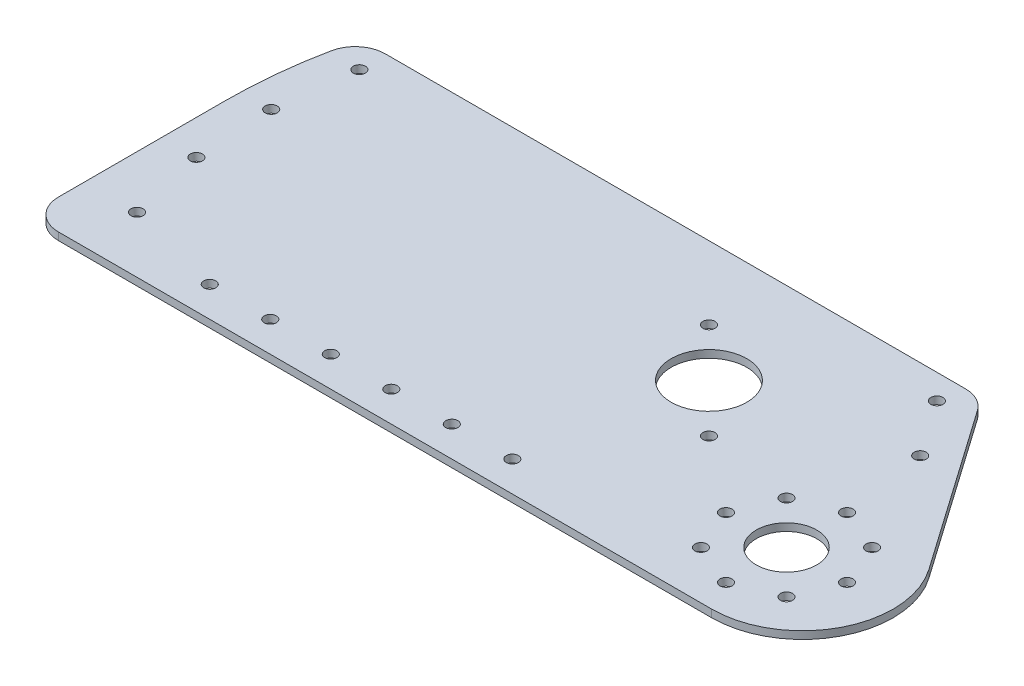
ISO-10303-21;
HEADER;
FILE_DESCRIPTION(('STEP AP214'),'2;1');
FILE_NAME('part.step','',(''),(''),'','','');
FILE_SCHEMA(('AUTOMOTIVE_DESIGN { 1 0 10303 214 1 1 1 1 }'));
ENDSEC;
DATA;
#1=APPLICATION_CONTEXT('core data for automotive mechanical design processes');
#2=APPLICATION_PROTOCOL_DEFINITION('international standard','automotive_design',2000,#1);
#3=PRODUCT_CONTEXT('',#1,'mechanical');
#4=PRODUCT('Part','Part','',(#3));
#5=PRODUCT_RELATED_PRODUCT_CATEGORY('part','',(#4));
#6=PRODUCT_DEFINITION_FORMATION('','',#4);
#7=PRODUCT_DEFINITION_CONTEXT('part definition',#1,'design');
#8=PRODUCT_DEFINITION('design','',#6,#7);
#9=PRODUCT_DEFINITION_SHAPE('','',#8);
#10=(LENGTH_UNIT() NAMED_UNIT(*) SI_UNIT(.MILLI.,.METRE.));
#11=(NAMED_UNIT(*) PLANE_ANGLE_UNIT() SI_UNIT($,.RADIAN.));
#12=(NAMED_UNIT(*) SI_UNIT($,.STERADIAN.) SOLID_ANGLE_UNIT());
#13=UNCERTAINTY_MEASURE_WITH_UNIT(LENGTH_MEASURE(1.E-05),#10,'distance_accuracy_value','');
#14=(GEOMETRIC_REPRESENTATION_CONTEXT(3) GLOBAL_UNCERTAINTY_ASSIGNED_CONTEXT((#13)) GLOBAL_UNIT_ASSIGNED_CONTEXT((#10,
#11,#12)) REPRESENTATION_CONTEXT('',''));
#15=CARTESIAN_POINT('',(0.,0.,0.));
#16=DIRECTION('',(0.,0.,1.));
#17=DIRECTION('',(1.,0.,0.));
#18=AXIS2_PLACEMENT_3D('',#15,#16,#17);
#19=CARTESIAN_POINT('',(-12.7,0.,69.8499999999995));
#20=DIRECTION('',(0.,1.,0.));
#21=DIRECTION('',(0.,0.,1.));
#22=AXIS2_PLACEMENT_3D('',#19,#20,#21);
#23=CYLINDRICAL_SURFACE('',#22,2.54000000000001);
#24=CARTESIAN_POINT('',(-12.7,0.,69.8499999999995));
#25=DIRECTION('',(0.,1.,0.));
#26=DIRECTION('',(0.,0.,1.));
#27=AXIS2_PLACEMENT_3D('',#24,#25,#26);
#28=CIRCLE('',#27,2.54000000000001);
#29=CARTESIAN_POINT('',(-12.7,0.,72.3899999999995));
#30=VERTEX_POINT('',#29);
#31=EDGE_CURVE('E51',#30,#30,#28,.T.);
#32=ORIENTED_EDGE('',*,*,#31,.F.);
#33=EDGE_LOOP('',(#32));
#34=FACE_BOUND('',#33,.T.);
#35=CARTESIAN_POINT('',(-12.7,3.175,69.8499999999995));
#36=DIRECTION('',(0.,1.,0.));
#37=DIRECTION('',(0.,0.,1.));
#38=AXIS2_PLACEMENT_3D('',#35,#36,#37);
#39=CIRCLE('',#38,2.54000000000001);
#40=CARTESIAN_POINT('',(-12.7,3.175,72.3899999999995));
#41=VERTEX_POINT('',#40);
#42=EDGE_CURVE('E11',#41,#41,#39,.T.);
#43=ORIENTED_EDGE('',*,*,#42,.T.);
#44=EDGE_LOOP('',(#43));
#45=FACE_BOUND('',#44,.T.);
#46=ADVANCED_FACE('F43',(#34,#45),#23,.F.);
#47=CARTESIAN_POINT('',(-38.1,0.,69.8499999999995));
#48=DIRECTION('',(0.,1.,0.));
#49=DIRECTION('',(0.,0.,1.));
#50=AXIS2_PLACEMENT_3D('',#47,#48,#49);
#51=CYLINDRICAL_SURFACE('',#50,2.54000000000001);
#52=CARTESIAN_POINT('',(-38.1,0.,69.8499999999995));
#53=DIRECTION('',(0.,1.,0.));
#54=DIRECTION('',(0.,0.,1.));
#55=AXIS2_PLACEMENT_3D('',#52,#53,#54);
#56=CIRCLE('',#55,2.54000000000001);
#57=CARTESIAN_POINT('',(-38.1,0.,72.3899999999995));
#58=VERTEX_POINT('',#57);
#59=EDGE_CURVE('E194',#58,#58,#56,.T.);
#60=ORIENTED_EDGE('',*,*,#59,.F.);
#61=EDGE_LOOP('',(#60));
#62=FACE_BOUND('',#61,.T.);
#63=CARTESIAN_POINT('',(-38.1,3.175,69.8499999999995));
#64=DIRECTION('',(0.,1.,0.));
#65=DIRECTION('',(0.,0.,1.));
#66=AXIS2_PLACEMENT_3D('',#63,#64,#65);
#67=CIRCLE('',#66,2.54000000000001);
#68=CARTESIAN_POINT('',(-38.1,3.175,72.3899999999995));
#69=VERTEX_POINT('',#68);
#70=EDGE_CURVE('E197',#69,#69,#67,.T.);
#71=ORIENTED_EDGE('',*,*,#70,.T.);
#72=EDGE_LOOP('',(#71));
#73=FACE_BOUND('',#72,.T.);
#74=ADVANCED_FACE('F206',(#62,#73),#51,.F.);
#75=CARTESIAN_POINT('',(-63.5,0.,69.8499999999995));
#76=DIRECTION('',(0.,1.,0.));
#77=DIRECTION('',(0.,0.,1.));
#78=AXIS2_PLACEMENT_3D('',#75,#76,#77);
#79=CYLINDRICAL_SURFACE('',#78,2.54000000000001);
#80=CARTESIAN_POINT('',(-63.5,0.,69.8499999999995));
#81=DIRECTION('',(0.,1.,0.));
#82=DIRECTION('',(0.,0.,1.));
#83=AXIS2_PLACEMENT_3D('',#80,#81,#82);
#84=CIRCLE('',#83,2.54000000000001);
#85=CARTESIAN_POINT('',(-63.5,0.,72.3899999999995));
#86=VERTEX_POINT('',#85);
#87=EDGE_CURVE('E188',#86,#86,#84,.T.);
#88=ORIENTED_EDGE('',*,*,#87,.F.);
#89=EDGE_LOOP('',(#88));
#90=FACE_BOUND('',#89,.T.);
#91=CARTESIAN_POINT('',(-63.5,3.175,69.8499999999995));
#92=DIRECTION('',(0.,1.,0.));
#93=DIRECTION('',(0.,0.,1.));
#94=AXIS2_PLACEMENT_3D('',#91,#92,#93);
#95=CIRCLE('',#94,2.54000000000001);
#96=CARTESIAN_POINT('',(-63.5,3.175,72.3899999999995));
#97=VERTEX_POINT('',#96);
#98=EDGE_CURVE('E191',#97,#97,#95,.T.);
#99=ORIENTED_EDGE('',*,*,#98,.T.);
#100=EDGE_LOOP('',(#99));
#101=FACE_BOUND('',#100,.T.);
#102=ADVANCED_FACE('F221',(#90,#101),#79,.F.);
#103=CARTESIAN_POINT('',(-88.9,0.,69.8499999999995));
#104=DIRECTION('',(0.,1.,0.));
#105=DIRECTION('',(0.,0.,1.));
#106=AXIS2_PLACEMENT_3D('',#103,#104,#105);
#107=CYLINDRICAL_SURFACE('',#106,2.54000000000001);
#108=CARTESIAN_POINT('',(-88.9,0.,69.8499999999995));
#109=DIRECTION('',(0.,1.,0.));
#110=DIRECTION('',(0.,0.,1.));
#111=AXIS2_PLACEMENT_3D('',#108,#109,#110);
#112=CIRCLE('',#111,2.54000000000001);
#113=CARTESIAN_POINT('',(-88.9,0.,72.3899999999995));
#114=VERTEX_POINT('',#113);
#115=EDGE_CURVE('E182',#114,#114,#112,.T.);
#116=ORIENTED_EDGE('',*,*,#115,.F.);
#117=EDGE_LOOP('',(#116));
#118=FACE_BOUND('',#117,.T.);
#119=CARTESIAN_POINT('',(-88.9,3.175,69.8499999999995));
#120=DIRECTION('',(0.,1.,0.));
#121=DIRECTION('',(0.,0.,1.));
#122=AXIS2_PLACEMENT_3D('',#119,#120,#121);
#123=CIRCLE('',#122,2.54000000000001);
#124=CARTESIAN_POINT('',(-88.9,3.175,72.3899999999995));
#125=VERTEX_POINT('',#124);
#126=EDGE_CURVE('E185',#125,#125,#123,.T.);
#127=ORIENTED_EDGE('',*,*,#126,.T.);
#128=EDGE_LOOP('',(#127));
#129=FACE_BOUND('',#128,.T.);
#130=ADVANCED_FACE('F210',(#118,#129),#107,.F.);
#131=CARTESIAN_POINT('',(0.,3.175,0.));
#132=DIRECTION('',(0.,1.,0.));
#133=DIRECTION('',(0.,0.,1.));
#134=AXIS2_PLACEMENT_3D('',#131,#132,#133);
#135=PLANE('',#134);
#136=CARTESIAN_POINT('',(20.2055762724056,3.175,20.2055762724056));
#137=DIRECTION('',(0.,1.,0.));
#138=DIRECTION('',(0.,0.,1.));
#139=AXIS2_PLACEMENT_3D('',#136,#137,#138);
#140=CIRCLE('',#139,2.54);
#141=CARTESIAN_POINT('',(20.2055762724056,3.175,22.7455762724056));
#142=VERTEX_POINT('',#141);
#143=EDGE_CURVE('E541',#142,#142,#140,.T.);
#144=ORIENTED_EDGE('',*,*,#143,.F.);
#145=EDGE_LOOP('',(#144));
#146=FACE_BOUND('',#145,.T.);
#147=CARTESIAN_POINT('',(-20.2055762724056,3.175,-20.2055762724056));
#148=DIRECTION('',(0.,1.,0.));
#149=DIRECTION('',(0.,0.,1.));
#150=AXIS2_PLACEMENT_3D('',#147,#148,#149);
#151=CIRCLE('',#150,2.54);
#152=CARTESIAN_POINT('',(-20.2055762724056,3.175,-17.6655762724056));
#153=VERTEX_POINT('',#152);
#154=EDGE_CURVE('E538',#153,#153,#151,.T.);
#155=ORIENTED_EDGE('',*,*,#154,.F.);
#156=EDGE_LOOP('',(#155));
#157=FACE_BOUND('',#156,.T.);
#158=CARTESIAN_POINT('',(-114.3,3.175,69.8499999999995));
#159=DIRECTION('',(0.,1.,0.));
#160=DIRECTION('',(0.,0.,1.));
#161=AXIS2_PLACEMENT_3D('',#158,#159,#160);
#162=CIRCLE('',#161,2.54000000000001);
#163=CARTESIAN_POINT('',(-114.3,3.175,72.3899999999995));
#164=VERTEX_POINT('',#163);
#165=EDGE_CURVE('E526',#164,#164,#162,.T.);
#166=ORIENTED_EDGE('',*,*,#165,.F.);
#167=EDGE_LOOP('',(#166));
#168=FACE_BOUND('',#167,.T.);
#169=CARTESIAN_POINT('',(-139.7,3.175,69.8499999999995));
#170=DIRECTION('',(0.,1.,0.));
#171=DIRECTION('',(0.,0.,1.));
#172=AXIS2_PLACEMENT_3D('',#169,#170,#171);
#173=CIRCLE('',#172,2.54000000000001);
#174=CARTESIAN_POINT('',(-139.7,3.175,72.3899999999995));
#175=VERTEX_POINT('',#174);
#176=EDGE_CURVE('E523',#175,#175,#173,.T.);
#177=ORIENTED_EDGE('',*,*,#176,.F.);
#178=EDGE_LOOP('',(#177));
#179=FACE_BOUND('',#178,.T.);
#180=CARTESIAN_POINT('',(-190.384422439555,3.175,-6.63488450215));
#181=DIRECTION('',(0.,1.,0.));
#182=DIRECTION('',(0.173648177666931,0.,0.984807753012208));
#183=AXIS2_PLACEMENT_3D('',#180,#181,#182);
#184=CIRCLE('',#183,2.54000000000001);
#185=CARTESIAN_POINT('',(-189.943356068282,3.175,-4.13347280949898));
#186=VERTEX_POINT('',#185);
#187=EDGE_CURVE('E518',#186,#186,#184,.T.);
#188=ORIENTED_EDGE('',*,*,#187,.F.);
#189=EDGE_LOOP('',(#188));
#190=FACE_BOUND('',#189,.T.);
#191=CARTESIAN_POINT('',(-188.644190874055,3.175,26.5258223147421));
#192=DIRECTION('',(0.,1.,0.));
#193=DIRECTION('',(0.342020143325669,0.,0.939692620785908));
#194=AXIS2_PLACEMENT_3D('',#191,#192,#193);
#195=CIRCLE('',#194,2.54000000000001);
#196=CARTESIAN_POINT('',(-187.775459710007,3.175,28.9126415715383));
#197=VERTEX_POINT('',#196);
#198=EDGE_CURVE('E512',#197,#197,#195,.T.);
#199=ORIENTED_EDGE('',*,*,#198,.F.);
#200=EDGE_LOOP('',(#199));
#201=FACE_BOUND('',#200,.T.);
#202=CARTESIAN_POINT('',(-181.172101027412,3.175,58.8805554433144));
#203=DIRECTION('',(0.,1.,0.));
#204=DIRECTION('',(0.500000000000001,0.,0.866025403784438));
#205=AXIS2_PLACEMENT_3D('',#202,#203,#204);
#206=CIRCLE('',#205,2.54000000000001);
#207=CARTESIAN_POINT('',(-179.902101027412,3.175,61.0802599689269));
#208=VERTEX_POINT('',#207);
#209=EDGE_CURVE('E505',#208,#208,#206,.T.);
#210=ORIENTED_EDGE('',*,*,#209,.F.);
#211=EDGE_LOOP('',(#210));
#212=FACE_BOUND('',#211,.T.);
#213=CARTESIAN_POINT('',(-186.339919668397,3.175,-39.5939937108578));
#214=DIRECTION('',(0.,1.,0.));
#215=DIRECTION('',(0.,0.,1.));
#216=AXIS2_PLACEMENT_3D('',#213,#214,#215);
#217=CIRCLE('',#216,2.54000000000001);
#218=CARTESIAN_POINT('',(-186.339919668397,3.175,-37.0539937108578));
#219=VERTEX_POINT('',#218);
#220=EDGE_CURVE('E499',#219,#219,#217,.T.);
#221=ORIENTED_EDGE('',*,*,#220,.F.);
#222=EDGE_LOOP('',(#221));
#223=FACE_BOUND('',#222,.T.);
#224=CARTESIAN_POINT('',(76.9896583964369,3.175,19.0499999999995));
#225=DIRECTION('',(0.,1.,0.));
#226=DIRECTION('',(1.,0.,0.));
#227=AXIS2_PLACEMENT_3D('',#224,#225,#226);
#228=CIRCLE('',#227,2.54);
#229=CARTESIAN_POINT('',(79.5296583964369,3.175,19.0499999999995));
#230=VERTEX_POINT('',#229);
#231=EDGE_CURVE('E494',#230,#230,#228,.T.);
#232=ORIENTED_EDGE('',*,*,#231,.F.);
#233=EDGE_LOOP('',(#232));
#234=FACE_BOUND('',#233,.T.);
#235=CARTESIAN_POINT('',(94.9501706385752,3.175,26.4894877578611));
#236=DIRECTION('',(0.,1.,0.));
#237=DIRECTION('',(1.,0.,0.));
#238=AXIS2_PLACEMENT_3D('',#235,#236,#237);
#239=CIRCLE('',#238,2.53999999999998);
#240=CARTESIAN_POINT('',(97.4901706385752,3.175,26.4894877578611));
#241=VERTEX_POINT('',#240);
#242=EDGE_CURVE('E488',#241,#241,#239,.T.);
#243=ORIENTED_EDGE('',*,*,#242,.F.);
#244=EDGE_LOOP('',(#243));
#245=FACE_BOUND('',#244,.T.);
#246=CARTESIAN_POINT('',(76.989658396437,3.175,69.8499999999995));
#247=DIRECTION('',(0.,1.,0.));
#248=DIRECTION('',(1.,0.,0.));
#249=AXIS2_PLACEMENT_3D('',#246,#247,#248);
#250=CIRCLE('',#249,2.53999999999999);
#251=CARTESIAN_POINT('',(79.529658396437,3.175,69.8499999999995));
#252=VERTEX_POINT('',#251);
#253=EDGE_CURVE('E481',#252,#252,#250,.T.);
#254=ORIENTED_EDGE('',*,*,#253,.F.);
#255=EDGE_LOOP('',(#254));
#256=FACE_BOUND('',#255,.T.);
#257=CARTESIAN_POINT('',(59.0291461542987,3.175,62.4105122421378));
#258=DIRECTION('',(0.,1.,0.));
#259=DIRECTION('',(1.,0.,0.));
#260=AXIS2_PLACEMENT_3D('',#257,#258,#259);
#261=CIRCLE('',#260,2.53999999999998);
#262=CARTESIAN_POINT('',(61.5691461542987,3.175,62.4105122421378));
#263=VERTEX_POINT('',#262);
#264=EDGE_CURVE('E475',#263,#263,#261,.T.);
#265=ORIENTED_EDGE('',*,*,#264,.F.);
#266=EDGE_LOOP('',(#265));
#267=FACE_BOUND('',#266,.T.);
#268=CARTESIAN_POINT('',(59.0291461542986,3.175,26.4894877578612));
#269=DIRECTION('',(0.,1.,0.));
#270=DIRECTION('',(0.,0.,1.));
#271=AXIS2_PLACEMENT_3D('',#268,#269,#270);
#272=CIRCLE('',#271,2.53999999999998);
#273=CARTESIAN_POINT('',(59.0291461542986,3.175,29.0294877578611));
#274=VERTEX_POINT('',#273);
#275=EDGE_CURVE('E470',#274,#274,#272,.T.);
#276=ORIENTED_EDGE('',*,*,#275,.F.);
#277=EDGE_LOOP('',(#276));
#278=FACE_BOUND('',#277,.T.);
#279=CARTESIAN_POINT('',(102.389658396437,3.175,44.4499999999995));
#280=DIRECTION('',(0.,1.,0.));
#281=DIRECTION('',(0.,0.,1.));
#282=AXIS2_PLACEMENT_3D('',#279,#280,#281);
#283=CIRCLE('',#282,2.54);
#284=CARTESIAN_POINT('',(102.389658396437,3.175,46.9899999999995));
#285=VERTEX_POINT('',#284);
#286=EDGE_CURVE('E467',#285,#285,#283,.T.);
#287=ORIENTED_EDGE('',*,*,#286,.F.);
#288=EDGE_LOOP('',(#287));
#289=FACE_BOUND('',#288,.T.);
#290=CARTESIAN_POINT('',(94.9501706385751,3.175,62.4105122421378));
#291=DIRECTION('',(0.,1.,0.));
#292=DIRECTION('',(0.,0.,1.));
#293=AXIS2_PLACEMENT_3D('',#290,#291,#292);
#294=CIRCLE('',#293,2.53999999999998);
#295=CARTESIAN_POINT('',(94.9501706385751,3.175,64.9505122421378));
#296=VERTEX_POINT('',#295);
#297=EDGE_CURVE('E461',#296,#296,#294,.T.);
#298=ORIENTED_EDGE('',*,*,#297,.F.);
#299=EDGE_LOOP('',(#298));
#300=FACE_BOUND('',#299,.T.);
#301=CARTESIAN_POINT('',(51.5896583964369,3.175,44.4499999999995));
#302=DIRECTION('',(0.,1.,0.));
#303=DIRECTION('',(0.,0.,1.));
#304=AXIS2_PLACEMENT_3D('',#301,#302,#303);
#305=CIRCLE('',#304,2.53999999999999);
#306=CARTESIAN_POINT('',(51.5896583964369,3.175,46.9899999999995));
#307=VERTEX_POINT('',#306);
#308=EDGE_CURVE('E454',#307,#307,#305,.T.);
#309=ORIENTED_EDGE('',*,*,#308,.F.);
#310=EDGE_LOOP('',(#309));
#311=FACE_BOUND('',#310,.T.);
#312=CARTESIAN_POINT('',(71.6705301331188,3.175,-16.9894993719718));
#313=DIRECTION('',(0.,1.,0.));
#314=DIRECTION('',(0.,0.,1.));
#315=AXIS2_PLACEMENT_3D('',#312,#313,#314);
#316=CIRCLE('',#315,2.54);
#317=CARTESIAN_POINT('',(71.6705301331188,3.175,-14.4494993719718));
#318=VERTEX_POINT('',#317);
#319=EDGE_CURVE('E445',#318,#318,#316,.T.);
#320=ORIENTED_EDGE('',*,*,#319,.F.);
#321=EDGE_LOOP('',(#320));
#322=FACE_BOUND('',#321,.T.);
#323=CARTESIAN_POINT('',(55.2805834643877,3.175,-40.3967690375298));
#324=DIRECTION('',(0.,1.,0.));
#325=DIRECTION('',(0.,0.,1.));
#326=AXIS2_PLACEMENT_3D('',#323,#324,#325);
#327=CIRCLE('',#326,2.54);
#328=CARTESIAN_POINT('',(55.2805834643877,3.175,-37.8567690375298));
#329=VERTEX_POINT('',#328);
#330=EDGE_CURVE('E398',#329,#329,#327,.T.);
#331=ORIENTED_EDGE('',*,*,#330,.F.);
#332=EDGE_LOOP('',(#331));
#333=FACE_BOUND('',#332,.T.);
#334=CARTESIAN_POINT('',(0.,3.175,0.));
#335=DIRECTION('',(0.,1.,0.));
#336=DIRECTION('',(0.,0.,1.));
#337=AXIS2_PLACEMENT_3D('',#334,#335,#336);
#338=CIRCLE('',#337,15.875);
#339=CARTESIAN_POINT('',(0.,3.175,15.875));
#340=VERTEX_POINT('',#339);
#341=EDGE_CURVE('E151',#340,#340,#338,.T.);
#342=ORIENTED_EDGE('',*,*,#341,.F.);
#343=EDGE_LOOP('',(#342));
#344=FACE_BOUND('',#343,.T.);
#345=CARTESIAN_POINT('',(0.,3.175,0.));
#346=DIRECTION('',(0.,1.,0.));
#347=DIRECTION('',(0.,0.,1.));
#348=AXIS2_PLACEMENT_3D('',#345,#346,#347);
#349=CIRCLE('',#348,203.2);
#350=CARTESIAN_POINT('',(-199.094526293417,3.175,-40.64));
#351=VERTEX_POINT('',#350);
#352=CARTESIAN_POINT('',(-203.2,3.175,0.));
#353=VERTEX_POINT('',#352);
#354=EDGE_CURVE('E164',#351,#353,#349,.T.);
#355=ORIENTED_EDGE('',*,*,#354,.T.);
#356=DIRECTION('',(0.,0.,1.));
#357=VECTOR('',#356,1.);
#358=CARTESIAN_POINT('',(-203.2,3.175,0.));
#359=LINE('',#358,#357);
#360=CARTESIAN_POINT('',(-203.2,3.175,69.8499999999995));
#361=VERTEX_POINT('',#360);
#362=EDGE_CURVE('E106',#353,#361,#359,.T.);
#363=ORIENTED_EDGE('',*,*,#362,.T.);
#364=CARTESIAN_POINT('',(-190.5,3.175,69.8499999999995));
#365=DIRECTION('',(0.,1.,0.));
#366=DIRECTION('',(0.,0.,-1.));
#367=AXIS2_PLACEMENT_3D('',#364,#365,#366);
#368=CIRCLE('',#367,12.7);
#369=CARTESIAN_POINT('',(-190.5,3.175,82.5499999999995));
#370=VERTEX_POINT('',#369);
#371=EDGE_CURVE('E408',#361,#370,#368,.T.);
#372=ORIENTED_EDGE('',*,*,#371,.T.);
#373=DIRECTION('',(1.,0.,0.));
#374=VECTOR('',#373,1.);
#375=CARTESIAN_POINT('',(83.6832561826628,3.175,82.5499999999994));
#376=LINE('',#375,#374);
#377=CARTESIAN_POINT('',(83.6832561826628,3.175,82.5499999999994));
#378=VERTEX_POINT('',#377);
#379=EDGE_CURVE('E410',#370,#378,#376,.T.);
#380=ORIENTED_EDGE('',*,*,#379,.T.);
#381=CARTESIAN_POINT('',(83.6832561826628,3.175,44.4499999999995));
#382=DIRECTION('',(0.,1.,0.));
#383=DIRECTION('',(0.,0.,1.));
#384=AXIS2_PLACEMENT_3D('',#381,#382,#383);
#385=CIRCLE('',#384,38.1);
#386=CARTESIAN_POINT('',(114.892949070073,3.175,22.5967377750247));
#387=VERTEX_POINT('',#386);
#388=EDGE_CURVE('E412',#378,#387,#385,.T.);
#389=ORIENTED_EDGE('',*,*,#388,.T.);
#390=DIRECTION('',(-0.573576436351044,0.,-0.819152044288993));
#391=VECTOR('',#390,1.);
#392=CARTESIAN_POINT('',(67.292029420463,3.175,-45.3844207416583));
#393=LINE('',#392,#391);
#394=CARTESIAN_POINT('',(67.292029420463,3.175,-45.3844207416583));
#395=VERTEX_POINT('',#394);
#396=EDGE_CURVE('E129',#387,#395,#393,.T.);
#397=ORIENTED_EDGE('',*,*,#396,.T.);
#398=CARTESIAN_POINT('',(56.8887984579928,3.175,-38.1));
#399=DIRECTION('',(0.,1.,0.));
#400=DIRECTION('',(0.,0.,1.));
#401=AXIS2_PLACEMENT_3D('',#398,#399,#400);
#402=CIRCLE('',#401,12.7);
#403=CARTESIAN_POINT('',(56.8887984579928,3.175,-50.8));
#404=VERTEX_POINT('',#403);
#405=EDGE_CURVE('E122',#395,#404,#402,.T.);
#406=ORIENTED_EDGE('',*,*,#405,.T.);
#407=DIRECTION('',(-1.,0.,0.));
#408=VECTOR('',#407,1.);
#409=CARTESIAN_POINT('',(-186.651118400078,3.175,-50.8));
#410=LINE('',#409,#408);
#411=CARTESIAN_POINT('',(-186.651118400078,3.175,-50.8));
#412=VERTEX_POINT('',#411);
#413=EDGE_CURVE('E127',#404,#412,#410,.T.);
#414=ORIENTED_EDGE('',*,*,#413,.T.);
#415=CARTESIAN_POINT('',(-186.651118400078,3.175,-38.1));
#416=DIRECTION('',(0.,1.,0.));
#417=DIRECTION('',(0.,0.,1.));
#418=AXIS2_PLACEMENT_3D('',#415,#416,#417);
#419=CIRCLE('',#418,12.7);
#420=EDGE_CURVE('E59',#412,#351,#419,.T.);
#421=ORIENTED_EDGE('',*,*,#420,.T.);
#422=EDGE_LOOP('',(#355,#363,#372,#380,#389,#397,#406,#414,#421));
#423=FACE_BOUND('',#422,.T.);
#424=CARTESIAN_POINT('',(76.9896583964369,3.175,44.4499999999994));
#425=DIRECTION('',(0.,1.,0.));
#426=DIRECTION('',(0.,0.,1.));
#427=AXIS2_PLACEMENT_3D('',#424,#425,#426);
#428=CIRCLE('',#427,12.6999999999999);
#429=CARTESIAN_POINT('',(76.9896583964369,3.175,57.1499999999993));
#430=VERTEX_POINT('',#429);
#431=EDGE_CURVE('E388',#430,#430,#428,.T.);
#432=ORIENTED_EDGE('',*,*,#431,.F.);
#433=EDGE_LOOP('',(#432));
#434=FACE_BOUND('',#433,.T.);
#435=ORIENTED_EDGE('',*,*,#126,.F.);
#436=EDGE_LOOP('',(#435));
#437=FACE_BOUND('',#436,.T.);
#438=ORIENTED_EDGE('',*,*,#98,.F.);
#439=EDGE_LOOP('',(#438));
#440=FACE_BOUND('',#439,.T.);
#441=ORIENTED_EDGE('',*,*,#70,.F.);
#442=EDGE_LOOP('',(#441));
#443=FACE_BOUND('',#442,.T.);
#444=ORIENTED_EDGE('',*,*,#42,.F.);
#445=EDGE_LOOP('',(#444));
#446=FACE_BOUND('',#445,.T.);
#447=ADVANCED_FACE('F124',(#146,#157,#168,#179,#190,#201,#212,#223,#234,#245,#256,#267,#278,
#289,#300,#311,#322,#333,#344,#423,#434,#437,#440,#443,#446),#135,.T.);
#448=CARTESIAN_POINT('',(0.,0.,0.));
#449=DIRECTION('',(0.,1.,0.));
#450=DIRECTION('',(0.,0.,1.));
#451=AXIS2_PLACEMENT_3D('',#448,#449,#450);
#452=PLANE('',#451);
#453=CARTESIAN_POINT('',(20.2055762724056,0.,20.2055762724056));
#454=DIRECTION('',(0.,1.,0.));
#455=DIRECTION('',(0.,0.,1.));
#456=AXIS2_PLACEMENT_3D('',#453,#454,#455);
#457=CIRCLE('',#456,2.54);
#458=CARTESIAN_POINT('',(20.2055762724056,0.,22.7455762724056));
#459=VERTEX_POINT('',#458);
#460=EDGE_CURVE('E534',#459,#459,#457,.T.);
#461=ORIENTED_EDGE('',*,*,#460,.T.);
#462=EDGE_LOOP('',(#461));
#463=FACE_BOUND('',#462,.T.);
#464=CARTESIAN_POINT('',(-20.2055762724056,0.,-20.2055762724056));
#465=DIRECTION('',(0.,1.,0.));
#466=DIRECTION('',(0.,0.,1.));
#467=AXIS2_PLACEMENT_3D('',#464,#465,#466);
#468=CIRCLE('',#467,2.54);
#469=CARTESIAN_POINT('',(-20.2055762724056,0.,-17.6655762724056));
#470=VERTEX_POINT('',#469);
#471=EDGE_CURVE('E535',#470,#470,#468,.T.);
#472=ORIENTED_EDGE('',*,*,#471,.T.);
#473=EDGE_LOOP('',(#472));
#474=FACE_BOUND('',#473,.T.);
#475=CARTESIAN_POINT('',(-114.3,0.,69.8499999999995));
#476=DIRECTION('',(0.,1.,0.));
#477=DIRECTION('',(0.,0.,1.));
#478=AXIS2_PLACEMENT_3D('',#475,#476,#477);
#479=CIRCLE('',#478,2.54000000000001);
#480=CARTESIAN_POINT('',(-114.3,0.,72.3899999999995));
#481=VERTEX_POINT('',#480);
#482=EDGE_CURVE('E531',#481,#481,#479,.T.);
#483=ORIENTED_EDGE('',*,*,#482,.T.);
#484=EDGE_LOOP('',(#483));
#485=FACE_BOUND('',#484,.T.);
#486=CARTESIAN_POINT('',(-139.7,0.,69.8499999999995));
#487=DIRECTION('',(0.,1.,0.));
#488=DIRECTION('',(0.,0.,1.));
#489=AXIS2_PLACEMENT_3D('',#486,#487,#488);
#490=CIRCLE('',#489,2.54000000000001);
#491=CARTESIAN_POINT('',(-139.7,0.,72.3899999999995));
#492=VERTEX_POINT('',#491);
#493=EDGE_CURVE('E509',#492,#492,#490,.T.);
#494=ORIENTED_EDGE('',*,*,#493,.T.);
#495=EDGE_LOOP('',(#494));
#496=FACE_BOUND('',#495,.T.);
#497=CARTESIAN_POINT('',(-190.384422439555,0.,-6.63488450215));
#498=DIRECTION('',(0.,1.,0.));
#499=DIRECTION('',(0.173648177666931,0.,0.984807753012208));
#500=AXIS2_PLACEMENT_3D('',#497,#498,#499);
#501=CIRCLE('',#500,2.54000000000001);
#502=CARTESIAN_POINT('',(-189.943356068282,0.,-4.13347280949898));
#503=VERTEX_POINT('',#502);
#504=EDGE_CURVE('E502',#503,#503,#501,.T.);
#505=ORIENTED_EDGE('',*,*,#504,.T.);
#506=EDGE_LOOP('',(#505));
#507=FACE_BOUND('',#506,.T.);
#508=CARTESIAN_POINT('',(-188.644190874055,0.,26.5258223147421));
#509=DIRECTION('',(0.,1.,0.));
#510=DIRECTION('',(0.342020143325669,0.,0.939692620785908));
#511=AXIS2_PLACEMENT_3D('',#508,#509,#510);
#512=CIRCLE('',#511,2.54000000000001);
#513=CARTESIAN_POINT('',(-187.775459710007,0.,28.9126415715383));
#514=VERTEX_POINT('',#513);
#515=EDGE_CURVE('E515',#514,#514,#512,.T.);
#516=ORIENTED_EDGE('',*,*,#515,.T.);
#517=EDGE_LOOP('',(#516));
#518=FACE_BOUND('',#517,.T.);
#519=CARTESIAN_POINT('',(-181.172101027412,0.,58.8805554433144));
#520=DIRECTION('',(0.,1.,0.));
#521=DIRECTION('',(0.500000000000001,0.,0.866025403784438));
#522=AXIS2_PLACEMENT_3D('',#519,#520,#521);
#523=CIRCLE('',#522,2.54000000000001);
#524=CARTESIAN_POINT('',(-179.902101027412,0.,61.0802599689269));
#525=VERTEX_POINT('',#524);
#526=EDGE_CURVE('E508',#525,#525,#523,.T.);
#527=ORIENTED_EDGE('',*,*,#526,.T.);
#528=EDGE_LOOP('',(#527));
#529=FACE_BOUND('',#528,.T.);
#530=CARTESIAN_POINT('',(-186.339919668397,0.,-39.5939937108578));
#531=DIRECTION('',(0.,1.,0.));
#532=DIRECTION('',(0.,0.,1.));
#533=AXIS2_PLACEMENT_3D('',#530,#531,#532);
#534=CIRCLE('',#533,2.54000000000001);
#535=CARTESIAN_POINT('',(-186.339919668397,0.,-37.0539937108578));
#536=VERTEX_POINT('',#535);
#537=EDGE_CURVE('E485',#536,#536,#534,.T.);
#538=ORIENTED_EDGE('',*,*,#537,.T.);
#539=EDGE_LOOP('',(#538));
#540=FACE_BOUND('',#539,.T.);
#541=CARTESIAN_POINT('',(76.9896583964369,0.,19.0499999999995));
#542=DIRECTION('',(0.,1.,0.));
#543=DIRECTION('',(1.,0.,0.));
#544=AXIS2_PLACEMENT_3D('',#541,#542,#543);
#545=CIRCLE('',#544,2.54);
#546=CARTESIAN_POINT('',(79.5296583964369,0.,19.0499999999995));
#547=VERTEX_POINT('',#546);
#548=EDGE_CURVE('E478',#547,#547,#545,.T.);
#549=ORIENTED_EDGE('',*,*,#548,.T.);
#550=EDGE_LOOP('',(#549));
#551=FACE_BOUND('',#550,.T.);
#552=CARTESIAN_POINT('',(94.9501706385752,0.,26.4894877578611));
#553=DIRECTION('',(0.,1.,0.));
#554=DIRECTION('',(1.,0.,0.));
#555=AXIS2_PLACEMENT_3D('',#552,#553,#554);
#556=CIRCLE('',#555,2.53999999999998);
#557=CARTESIAN_POINT('',(97.4901706385752,0.,26.4894877578611));
#558=VERTEX_POINT('',#557);
#559=EDGE_CURVE('E491',#558,#558,#556,.T.);
#560=ORIENTED_EDGE('',*,*,#559,.T.);
#561=EDGE_LOOP('',(#560));
#562=FACE_BOUND('',#561,.T.);
#563=CARTESIAN_POINT('',(76.989658396437,0.,69.8499999999995));
#564=DIRECTION('',(0.,1.,0.));
#565=DIRECTION('',(1.,0.,0.));
#566=AXIS2_PLACEMENT_3D('',#563,#564,#565);
#567=CIRCLE('',#566,2.53999999999999);
#568=CARTESIAN_POINT('',(79.529658396437,0.,69.8499999999995));
#569=VERTEX_POINT('',#568);
#570=EDGE_CURVE('E484',#569,#569,#567,.T.);
#571=ORIENTED_EDGE('',*,*,#570,.T.);
#572=EDGE_LOOP('',(#571));
#573=FACE_BOUND('',#572,.T.);
#574=CARTESIAN_POINT('',(59.0291461542987,0.,62.4105122421378));
#575=DIRECTION('',(0.,1.,0.));
#576=DIRECTION('',(1.,0.,0.));
#577=AXIS2_PLACEMENT_3D('',#574,#575,#576);
#578=CIRCLE('',#577,2.53999999999998);
#579=CARTESIAN_POINT('',(61.5691461542987,0.,62.4105122421378));
#580=VERTEX_POINT('',#579);
#581=EDGE_CURVE('E455',#580,#580,#578,.T.);
#582=ORIENTED_EDGE('',*,*,#581,.T.);
#583=EDGE_LOOP('',(#582));
#584=FACE_BOUND('',#583,.T.);
#585=CARTESIAN_POINT('',(59.0291461542986,0.,26.4894877578612));
#586=DIRECTION('',(0.,1.,0.));
#587=DIRECTION('',(0.,0.,1.));
#588=AXIS2_PLACEMENT_3D('',#585,#586,#587);
#589=CIRCLE('',#588,2.53999999999998);
#590=CARTESIAN_POINT('',(59.0291461542986,0.,29.0294877578611));
#591=VERTEX_POINT('',#590);
#592=EDGE_CURVE('E448',#591,#591,#589,.T.);
#593=ORIENTED_EDGE('',*,*,#592,.T.);
#594=EDGE_LOOP('',(#593));
#595=FACE_BOUND('',#594,.T.);
#596=CARTESIAN_POINT('',(102.389658396437,0.,44.4499999999995));
#597=DIRECTION('',(0.,1.,0.));
#598=DIRECTION('',(0.,0.,1.));
#599=AXIS2_PLACEMENT_3D('',#596,#597,#598);
#600=CIRCLE('',#599,2.54);
#601=CARTESIAN_POINT('',(102.389658396437,0.,46.9899999999995));
#602=VERTEX_POINT('',#601);
#603=EDGE_CURVE('E464',#602,#602,#600,.T.);
#604=ORIENTED_EDGE('',*,*,#603,.T.);
#605=EDGE_LOOP('',(#604));
#606=FACE_BOUND('',#605,.T.);
#607=CARTESIAN_POINT('',(94.9501706385751,0.,62.4105122421378));
#608=DIRECTION('',(0.,1.,0.));
#609=DIRECTION('',(0.,0.,1.));
#610=AXIS2_PLACEMENT_3D('',#607,#608,#609);
#611=CIRCLE('',#610,2.53999999999998);
#612=CARTESIAN_POINT('',(94.9501706385751,0.,64.9505122421378));
#613=VERTEX_POINT('',#612);
#614=EDGE_CURVE('E458',#613,#613,#611,.T.);
#615=ORIENTED_EDGE('',*,*,#614,.T.);
#616=EDGE_LOOP('',(#615));
#617=FACE_BOUND('',#616,.T.);
#618=CARTESIAN_POINT('',(51.5896583964369,0.,44.4499999999995));
#619=DIRECTION('',(0.,1.,0.));
#620=DIRECTION('',(0.,0.,1.));
#621=AXIS2_PLACEMENT_3D('',#618,#619,#620);
#622=CIRCLE('',#621,2.53999999999999);
#623=CARTESIAN_POINT('',(51.5896583964369,0.,46.9899999999995));
#624=VERTEX_POINT('',#623);
#625=EDGE_CURVE('E451',#624,#624,#622,.T.);
#626=ORIENTED_EDGE('',*,*,#625,.T.);
#627=EDGE_LOOP('',(#626));
#628=FACE_BOUND('',#627,.T.);
#629=CARTESIAN_POINT('',(71.6705301331188,0.,-16.9894993719718));
#630=DIRECTION('',(0.,1.,0.));
#631=DIRECTION('',(0.,0.,1.));
#632=AXIS2_PLACEMENT_3D('',#629,#630,#631);
#633=CIRCLE('',#632,2.54);
#634=CARTESIAN_POINT('',(71.6705301331188,0.,-14.4494993719718));
#635=VERTEX_POINT('',#634);
#636=EDGE_CURVE('E443',#635,#635,#633,.T.);
#637=ORIENTED_EDGE('',*,*,#636,.T.);
#638=EDGE_LOOP('',(#637));
#639=FACE_BOUND('',#638,.T.);
#640=CARTESIAN_POINT('',(55.2805834643877,0.,-40.3967690375298));
#641=DIRECTION('',(0.,1.,0.));
#642=DIRECTION('',(0.,0.,1.));
#643=AXIS2_PLACEMENT_3D('',#640,#641,#642);
#644=CIRCLE('',#643,2.54);
#645=CARTESIAN_POINT('',(55.2805834643877,0.,-37.8567690375298));
#646=VERTEX_POINT('',#645);
#647=EDGE_CURVE('E393',#646,#646,#644,.T.);
#648=ORIENTED_EDGE('',*,*,#647,.T.);
#649=EDGE_LOOP('',(#648));
#650=FACE_BOUND('',#649,.T.);
#651=CARTESIAN_POINT('',(0.,0.,0.));
#652=DIRECTION('',(0.,1.,0.));
#653=DIRECTION('',(0.,0.,1.));
#654=AXIS2_PLACEMENT_3D('',#651,#652,#653);
#655=CIRCLE('',#654,203.2);
#656=CARTESIAN_POINT('',(-199.094526293417,0.,-40.64));
#657=VERTEX_POINT('',#656);
#658=CARTESIAN_POINT('',(-203.2,0.,0.));
#659=VERTEX_POINT('',#658);
#660=EDGE_CURVE('E147',#657,#659,#655,.T.);
#661=ORIENTED_EDGE('',*,*,#660,.F.);
#662=CARTESIAN_POINT('',(-186.651118400078,0.,-38.1));
#663=DIRECTION('',(0.,1.,0.));
#664=DIRECTION('',(0.,0.,1.));
#665=AXIS2_PLACEMENT_3D('',#662,#663,#664);
#666=CIRCLE('',#665,12.7);
#667=CARTESIAN_POINT('',(-186.651118400078,0.,-50.8));
#668=VERTEX_POINT('',#667);
#669=EDGE_CURVE('E97',#668,#657,#666,.T.);
#670=ORIENTED_EDGE('',*,*,#669,.F.);
#671=DIRECTION('',(-1.,0.,0.));
#672=VECTOR('',#671,1.);
#673=CARTESIAN_POINT('',(-186.651118400078,0.,-50.8));
#674=LINE('',#673,#672);
#675=CARTESIAN_POINT('',(56.8887984579928,0.,-50.8));
#676=VERTEX_POINT('',#675);
#677=EDGE_CURVE('E91',#676,#668,#674,.T.);
#678=ORIENTED_EDGE('',*,*,#677,.F.);
#679=CARTESIAN_POINT('',(56.8887984579928,0.,-38.1));
#680=DIRECTION('',(0.,1.,0.));
#681=DIRECTION('',(0.,0.,1.));
#682=AXIS2_PLACEMENT_3D('',#679,#680,#681);
#683=CIRCLE('',#682,12.7);
#684=CARTESIAN_POINT('',(67.292029420463,0.,-45.3844207416583));
#685=VERTEX_POINT('',#684);
#686=EDGE_CURVE('E137',#685,#676,#683,.T.);
#687=ORIENTED_EDGE('',*,*,#686,.F.);
#688=DIRECTION('',(-0.573576436351044,0.,-0.819152044288993));
#689=VECTOR('',#688,1.);
#690=CARTESIAN_POINT('',(67.292029420463,0.,-45.3844207416583));
#691=LINE('',#690,#689);
#692=CARTESIAN_POINT('',(114.892949070073,0.,22.5967377750247));
#693=VERTEX_POINT('',#692);
#694=EDGE_CURVE('E159',#693,#685,#691,.T.);
#695=ORIENTED_EDGE('',*,*,#694,.F.);
#696=CARTESIAN_POINT('',(83.6832561826628,0.,44.4499999999995));
#697=DIRECTION('',(0.,1.,0.));
#698=DIRECTION('',(0.,0.,1.));
#699=AXIS2_PLACEMENT_3D('',#696,#697,#698);
#700=CIRCLE('',#699,38.1);
#701=CARTESIAN_POINT('',(83.6832561826628,0.,82.5499999999994));
#702=VERTEX_POINT('',#701);
#703=EDGE_CURVE('E157',#702,#693,#700,.T.);
#704=ORIENTED_EDGE('',*,*,#703,.F.);
#705=DIRECTION('',(1.,0.,0.));
#706=VECTOR('',#705,1.);
#707=CARTESIAN_POINT('',(83.6832561826628,0.,82.5499999999994));
#708=LINE('',#707,#706);
#709=CARTESIAN_POINT('',(-190.5,0.,82.5499999999995));
#710=VERTEX_POINT('',#709);
#711=EDGE_CURVE('E155',#710,#702,#708,.T.);
#712=ORIENTED_EDGE('',*,*,#711,.F.);
#713=CARTESIAN_POINT('',(-190.5,0.,69.8499999999995));
#714=DIRECTION('',(0.,1.,0.));
#715=DIRECTION('',(0.,0.,-1.));
#716=AXIS2_PLACEMENT_3D('',#713,#714,#715);
#717=CIRCLE('',#716,12.7);
#718=CARTESIAN_POINT('',(-203.2,0.,69.8499999999995));
#719=VERTEX_POINT('',#718);
#720=EDGE_CURVE('E153',#719,#710,#717,.T.);
#721=ORIENTED_EDGE('',*,*,#720,.F.);
#722=DIRECTION('',(0.,0.,1.));
#723=VECTOR('',#722,1.);
#724=CARTESIAN_POINT('',(-203.2,0.,0.));
#725=LINE('',#724,#723);
#726=EDGE_CURVE('E150',#659,#719,#725,.T.);
#727=ORIENTED_EDGE('',*,*,#726,.F.);
#728=EDGE_LOOP('',(#661,#670,#678,#687,#695,#704,#712,#721,#727));
#729=FACE_BOUND('',#728,.T.);
#730=CARTESIAN_POINT('',(0.,0.,0.));
#731=DIRECTION('',(0.,1.,0.));
#732=DIRECTION('',(0.,0.,1.));
#733=AXIS2_PLACEMENT_3D('',#730,#731,#732);
#734=CIRCLE('',#733,15.875);
#735=CARTESIAN_POINT('',(0.,0.,15.875));
#736=VERTEX_POINT('',#735);
#737=EDGE_CURVE('E395',#736,#736,#734,.T.);
#738=ORIENTED_EDGE('',*,*,#737,.T.);
#739=EDGE_LOOP('',(#738));
#740=FACE_BOUND('',#739,.T.);
#741=CARTESIAN_POINT('',(76.9896583964369,0.,44.4499999999994));
#742=DIRECTION('',(0.,1.,0.));
#743=DIRECTION('',(0.,0.,1.));
#744=AXIS2_PLACEMENT_3D('',#741,#742,#743);
#745=CIRCLE('',#744,12.6999999999999);
#746=CARTESIAN_POINT('',(76.9896583964369,0.,57.1499999999993));
#747=VERTEX_POINT('',#746);
#748=EDGE_CURVE('E391',#747,#747,#745,.T.);
#749=ORIENTED_EDGE('',*,*,#748,.T.);
#750=EDGE_LOOP('',(#749));
#751=FACE_BOUND('',#750,.T.);
#752=ORIENTED_EDGE('',*,*,#115,.T.);
#753=EDGE_LOOP('',(#752));
#754=FACE_BOUND('',#753,.T.);
#755=ORIENTED_EDGE('',*,*,#87,.T.);
#756=EDGE_LOOP('',(#755));
#757=FACE_BOUND('',#756,.T.);
#758=ORIENTED_EDGE('',*,*,#59,.T.);
#759=EDGE_LOOP('',(#758));
#760=FACE_BOUND('',#759,.T.);
#761=ORIENTED_EDGE('',*,*,#31,.T.);
#762=EDGE_LOOP('',(#761));
#763=FACE_BOUND('',#762,.T.);
#764=ADVANCED_FACE('F202',(#463,#474,#485,#496,#507,#518,#529,#540,#551,#562,#573,#584,#595,
#606,#617,#628,#639,#650,#729,#740,#751,#754,#757,#760,#763),#452,.F.);
#765=CARTESIAN_POINT('',(0.,3.175,0.));
#766=DIRECTION('',(0.,-1.,0.));
#767=DIRECTION('',(0.,0.,-1.));
#768=AXIS2_PLACEMENT_3D('',#765,#766,#767);
#769=CYLINDRICAL_SURFACE('',#768,203.2);
#770=ORIENTED_EDGE('',*,*,#660,.T.);
#771=DIRECTION('',(0.,-1.,0.));
#772=VECTOR('',#771,1.);
#773=CARTESIAN_POINT('',(-203.2,3.175,0.));
#774=LINE('',#773,#772);
#775=EDGE_CURVE('E180',#353,#659,#774,.T.);
#776=ORIENTED_EDGE('',*,*,#775,.F.);
#777=ORIENTED_EDGE('',*,*,#354,.F.);
#778=DIRECTION('',(0.,-1.,0.));
#779=VECTOR('',#778,1.);
#780=CARTESIAN_POINT('',(-199.094526293417,3.175,-40.64));
#781=LINE('',#780,#779);
#782=EDGE_CURVE('E143',#351,#657,#781,.T.);
#783=ORIENTED_EDGE('',*,*,#782,.T.);
#784=EDGE_LOOP('',(#770,#776,#777,#783));
#785=FACE_BOUND('',#784,.T.);
#786=ADVANCED_FACE('F217',(#785),#769,.T.);
#787=CARTESIAN_POINT('',(-203.2,3.175,0.));
#788=DIRECTION('',(1.,0.,0.));
#789=DIRECTION('',(0.,0.,-1.));
#790=AXIS2_PLACEMENT_3D('',#787,#788,#789);
#791=PLANE('',#790);
#792=ORIENTED_EDGE('',*,*,#726,.T.);
#793=DIRECTION('',(0.,-1.,0.));
#794=VECTOR('',#793,1.);
#795=CARTESIAN_POINT('',(-203.2,3.175,69.8499999999995));
#796=LINE('',#795,#794);
#797=EDGE_CURVE('E177',#361,#719,#796,.T.);
#798=ORIENTED_EDGE('',*,*,#797,.F.);
#799=ORIENTED_EDGE('',*,*,#362,.F.);
#800=ORIENTED_EDGE('',*,*,#775,.T.);
#801=EDGE_LOOP('',(#792,#798,#799,#800));
#802=FACE_BOUND('',#801,.T.);
#803=ADVANCED_FACE('F252',(#802),#791,.F.);
#804=CARTESIAN_POINT('',(-190.5,3.175,69.8499999999995));
#805=DIRECTION('',(0.,-1.,0.));
#806=DIRECTION('',(0.,0.,-1.));
#807=AXIS2_PLACEMENT_3D('',#804,#805,#806);
#808=CYLINDRICAL_SURFACE('',#807,12.7);
#809=ORIENTED_EDGE('',*,*,#720,.T.);
#810=DIRECTION('',(0.,-1.,0.));
#811=VECTOR('',#810,1.);
#812=CARTESIAN_POINT('',(-190.5,3.175,82.5499999999995));
#813=LINE('',#812,#811);
#814=EDGE_CURVE('E174',#370,#710,#813,.T.);
#815=ORIENTED_EDGE('',*,*,#814,.F.);
#816=ORIENTED_EDGE('',*,*,#371,.F.);
#817=ORIENTED_EDGE('',*,*,#797,.T.);
#818=EDGE_LOOP('',(#809,#815,#816,#817));
#819=FACE_BOUND('',#818,.T.);
#820=ADVANCED_FACE('F248',(#819),#808,.T.);
#821=CARTESIAN_POINT('',(83.6832561826628,3.175,82.5499999999994));
#822=DIRECTION('',(0.,0.,-1.));
#823=DIRECTION('',(-1.,0.,0.));
#824=AXIS2_PLACEMENT_3D('',#821,#822,#823);
#825=PLANE('',#824);
#826=ORIENTED_EDGE('',*,*,#711,.T.);
#827=DIRECTION('',(0.,-1.,0.));
#828=VECTOR('',#827,1.);
#829=CARTESIAN_POINT('',(83.6832561826628,3.175,82.5499999999994));
#830=LINE('',#829,#828);
#831=EDGE_CURVE('E171',#378,#702,#830,.T.);
#832=ORIENTED_EDGE('',*,*,#831,.F.);
#833=ORIENTED_EDGE('',*,*,#379,.F.);
#834=ORIENTED_EDGE('',*,*,#814,.T.);
#835=EDGE_LOOP('',(#826,#832,#833,#834));
#836=FACE_BOUND('',#835,.T.);
#837=ADVANCED_FACE('F244',(#836),#825,.F.);
#838=CARTESIAN_POINT('',(83.6832561826628,3.175,44.4499999999995));
#839=DIRECTION('',(0.,-1.,0.));
#840=DIRECTION('',(0.,0.,-1.));
#841=AXIS2_PLACEMENT_3D('',#838,#839,#840);
#842=CYLINDRICAL_SURFACE('',#841,38.1);
#843=ORIENTED_EDGE('',*,*,#703,.T.);
#844=DIRECTION('',(0.,-1.,0.));
#845=VECTOR('',#844,1.);
#846=CARTESIAN_POINT('',(114.892949070073,3.175,22.5967377750247));
#847=LINE('',#846,#845);
#848=EDGE_CURVE('E168',#387,#693,#847,.T.);
#849=ORIENTED_EDGE('',*,*,#848,.F.);
#850=ORIENTED_EDGE('',*,*,#388,.F.);
#851=ORIENTED_EDGE('',*,*,#831,.T.);
#852=EDGE_LOOP('',(#843,#849,#850,#851));
#853=FACE_BOUND('',#852,.T.);
#854=ADVANCED_FACE('F240',(#853),#842,.T.);
#855=CARTESIAN_POINT('',(67.292029420463,3.175,-45.3844207416583));
#856=DIRECTION('',(-0.819152044288993,0.,0.573576436351044));
#857=DIRECTION('',(0.573576436351045,0.,0.819152044288993));
#858=AXIS2_PLACEMENT_3D('',#855,#856,#857);
#859=PLANE('',#858);
#860=ORIENTED_EDGE('',*,*,#694,.T.);
#861=DIRECTION('',(0.,-1.,0.));
#862=VECTOR('',#861,1.);
#863=CARTESIAN_POINT('',(67.292029420463,3.175,-45.3844207416583));
#864=LINE('',#863,#862);
#865=EDGE_CURVE('E138',#395,#685,#864,.T.);
#866=ORIENTED_EDGE('',*,*,#865,.F.);
#867=ORIENTED_EDGE('',*,*,#396,.F.);
#868=ORIENTED_EDGE('',*,*,#848,.T.);
#869=EDGE_LOOP('',(#860,#866,#867,#868));
#870=FACE_BOUND('',#869,.T.);
#871=ADVANCED_FACE('F237',(#870),#859,.F.);
#872=CARTESIAN_POINT('',(56.8887984579928,3.175,-38.1));
#873=DIRECTION('',(0.,-1.,0.));
#874=DIRECTION('',(0.,0.,-1.));
#875=AXIS2_PLACEMENT_3D('',#872,#873,#874);
#876=CYLINDRICAL_SURFACE('',#875,12.7);
#877=ORIENTED_EDGE('',*,*,#686,.T.);
#878=DIRECTION('',(0.,-1.,0.));
#879=VECTOR('',#878,1.);
#880=CARTESIAN_POINT('',(56.8887984579928,3.175,-50.8));
#881=LINE('',#880,#879);
#882=EDGE_CURVE('E134',#404,#676,#881,.T.);
#883=ORIENTED_EDGE('',*,*,#882,.F.);
#884=ORIENTED_EDGE('',*,*,#405,.F.);
#885=ORIENTED_EDGE('',*,*,#865,.T.);
#886=EDGE_LOOP('',(#877,#883,#884,#885));
#887=FACE_BOUND('',#886,.T.);
#888=ADVANCED_FACE('F135',(#887),#876,.T.);
#889=CARTESIAN_POINT('',(-186.651118400078,3.175,-50.8));
#890=DIRECTION('',(0.,0.,1.));
#891=DIRECTION('',(1.,0.,0.));
#892=AXIS2_PLACEMENT_3D('',#889,#890,#891);
#893=PLANE('',#892);
#894=ORIENTED_EDGE('',*,*,#677,.T.);
#895=DIRECTION('',(0.,-1.,0.));
#896=VECTOR('',#895,1.);
#897=CARTESIAN_POINT('',(-186.651118400078,3.175,-50.8));
#898=LINE('',#897,#896);
#899=EDGE_CURVE('E139',#412,#668,#898,.T.);
#900=ORIENTED_EDGE('',*,*,#899,.F.);
#901=ORIENTED_EDGE('',*,*,#413,.F.);
#902=ORIENTED_EDGE('',*,*,#882,.T.);
#903=EDGE_LOOP('',(#894,#900,#901,#902));
#904=FACE_BOUND('',#903,.T.);
#905=ADVANCED_FACE('F141',(#904),#893,.F.);
#906=CARTESIAN_POINT('',(-186.651118400078,3.175,-38.1));
#907=DIRECTION('',(0.,-1.,0.));
#908=DIRECTION('',(0.,0.,-1.));
#909=AXIS2_PLACEMENT_3D('',#906,#907,#908);
#910=CYLINDRICAL_SURFACE('',#909,12.7);
#911=ORIENTED_EDGE('',*,*,#669,.T.);
#912=ORIENTED_EDGE('',*,*,#782,.F.);
#913=ORIENTED_EDGE('',*,*,#420,.F.);
#914=ORIENTED_EDGE('',*,*,#899,.T.);
#915=EDGE_LOOP('',(#911,#912,#913,#914));
#916=FACE_BOUND('',#915,.T.);
#917=ADVANCED_FACE('F230',(#916),#910,.T.);
#918=CARTESIAN_POINT('',(0.,3.175,0.));
#919=DIRECTION('',(0.,-1.,0.));
#920=DIRECTION('',(0.,0.,-1.));
#921=AXIS2_PLACEMENT_3D('',#918,#919,#920);
#922=CYLINDRICAL_SURFACE('',#921,15.875);
#923=ORIENTED_EDGE('',*,*,#341,.T.);
#924=EDGE_LOOP('',(#923));
#925=FACE_BOUND('',#924,.T.);
#926=ORIENTED_EDGE('',*,*,#737,.F.);
#927=EDGE_LOOP('',(#926));
#928=FACE_BOUND('',#927,.T.);
#929=ADVANCED_FACE('F227',(#925,#928),#922,.F.);
#930=CARTESIAN_POINT('',(76.9896583964369,3.175,44.4499999999994));
#931=DIRECTION('',(0.,-1.,0.));
#932=DIRECTION('',(0.,0.,-1.));
#933=AXIS2_PLACEMENT_3D('',#930,#931,#932);
#934=CYLINDRICAL_SURFACE('',#933,12.6999999999999);
#935=ORIENTED_EDGE('',*,*,#431,.T.);
#936=EDGE_LOOP('',(#935));
#937=FACE_BOUND('',#936,.T.);
#938=ORIENTED_EDGE('',*,*,#748,.F.);
#939=EDGE_LOOP('',(#938));
#940=FACE_BOUND('',#939,.T.);
#941=ADVANCED_FACE('F377',(#937,#940),#934,.F.);
#942=CARTESIAN_POINT('',(55.2805834643877,0.,-40.3967690375298));
#943=DIRECTION('',(0.,1.,0.));
#944=DIRECTION('',(0.,0.,1.));
#945=AXIS2_PLACEMENT_3D('',#942,#943,#944);
#946=CYLINDRICAL_SURFACE('',#945,2.54);
#947=ORIENTED_EDGE('',*,*,#647,.F.);
#948=EDGE_LOOP('',(#947));
#949=FACE_BOUND('',#948,.T.);
#950=ORIENTED_EDGE('',*,*,#330,.T.);
#951=EDGE_LOOP('',(#950));
#952=FACE_BOUND('',#951,.T.);
#953=ADVANCED_FACE('F374',(#949,#952),#946,.F.);
#954=CARTESIAN_POINT('',(71.6705301331188,0.,-16.9894993719718));
#955=DIRECTION('',(0.,1.,0.));
#956=DIRECTION('',(0.,0.,1.));
#957=AXIS2_PLACEMENT_3D('',#954,#955,#956);
#958=CYLINDRICAL_SURFACE('',#957,2.54);
#959=ORIENTED_EDGE('',*,*,#636,.F.);
#960=EDGE_LOOP('',(#959));
#961=FACE_BOUND('',#960,.T.);
#962=ORIENTED_EDGE('',*,*,#319,.T.);
#963=EDGE_LOOP('',(#962));
#964=FACE_BOUND('',#963,.T.);
#965=ADVANCED_FACE('F370',(#961,#964),#958,.F.);
#966=CARTESIAN_POINT('',(51.5896583964369,0.,44.4499999999995));
#967=DIRECTION('',(0.,1.,0.));
#968=DIRECTION('',(0.,0.,1.));
#969=AXIS2_PLACEMENT_3D('',#966,#967,#968);
#970=CYLINDRICAL_SURFACE('',#969,2.53999999999999);
#971=ORIENTED_EDGE('',*,*,#625,.F.);
#972=EDGE_LOOP('',(#971));
#973=FACE_BOUND('',#972,.T.);
#974=ORIENTED_EDGE('',*,*,#308,.T.);
#975=EDGE_LOOP('',(#974));
#976=FACE_BOUND('',#975,.T.);
#977=ADVANCED_FACE('F366',(#973,#976),#970,.F.);
#978=CARTESIAN_POINT('',(94.9501706385751,0.,62.4105122421378));
#979=DIRECTION('',(0.,1.,0.));
#980=DIRECTION('',(0.,0.,1.));
#981=AXIS2_PLACEMENT_3D('',#978,#979,#980);
#982=CYLINDRICAL_SURFACE('',#981,2.53999999999998);
#983=ORIENTED_EDGE('',*,*,#614,.F.);
#984=EDGE_LOOP('',(#983));
#985=FACE_BOUND('',#984,.T.);
#986=ORIENTED_EDGE('',*,*,#297,.T.);
#987=EDGE_LOOP('',(#986));
#988=FACE_BOUND('',#987,.T.);
#989=ADVANCED_FACE('F362',(#985,#988),#982,.F.);
#990=CARTESIAN_POINT('',(102.389658396437,0.,44.4499999999995));
#991=DIRECTION('',(0.,1.,0.));
#992=DIRECTION('',(0.,0.,1.));
#993=AXIS2_PLACEMENT_3D('',#990,#991,#992);
#994=CYLINDRICAL_SURFACE('',#993,2.54);
#995=ORIENTED_EDGE('',*,*,#603,.F.);
#996=EDGE_LOOP('',(#995));
#997=FACE_BOUND('',#996,.T.);
#998=ORIENTED_EDGE('',*,*,#286,.T.);
#999=EDGE_LOOP('',(#998));
#1000=FACE_BOUND('',#999,.T.);
#1001=ADVANCED_FACE('F358',(#997,#1000),#994,.F.);
#1002=CARTESIAN_POINT('',(59.0291461542986,0.,26.4894877578612));
#1003=DIRECTION('',(0.,1.,0.));
#1004=DIRECTION('',(0.,0.,1.));
#1005=AXIS2_PLACEMENT_3D('',#1002,#1003,#1004);
#1006=CYLINDRICAL_SURFACE('',#1005,2.53999999999998);
#1007=ORIENTED_EDGE('',*,*,#592,.F.);
#1008=EDGE_LOOP('',(#1007));
#1009=FACE_BOUND('',#1008,.T.);
#1010=ORIENTED_EDGE('',*,*,#275,.T.);
#1011=EDGE_LOOP('',(#1010));
#1012=FACE_BOUND('',#1011,.T.);
#1013=ADVANCED_FACE('F354',(#1009,#1012),#1006,.F.);
#1014=CARTESIAN_POINT('',(59.0291461542987,0.,62.4105122421378));
#1015=DIRECTION('',(0.,1.,0.));
#1016=DIRECTION('',(0.,0.,1.));
#1017=AXIS2_PLACEMENT_3D('',#1014,#1015,#1016);
#1018=CYLINDRICAL_SURFACE('',#1017,2.53999999999998);
#1019=ORIENTED_EDGE('',*,*,#581,.F.);
#1020=EDGE_LOOP('',(#1019));
#1021=FACE_BOUND('',#1020,.T.);
#1022=ORIENTED_EDGE('',*,*,#264,.T.);
#1023=EDGE_LOOP('',(#1022));
#1024=FACE_BOUND('',#1023,.T.);
#1025=ADVANCED_FACE('F350',(#1021,#1024),#1018,.F.);
#1026=CARTESIAN_POINT('',(76.989658396437,0.,69.8499999999995));
#1027=DIRECTION('',(0.,1.,0.));
#1028=DIRECTION('',(0.,0.,1.));
#1029=AXIS2_PLACEMENT_3D('',#1026,#1027,#1028);
#1030=CYLINDRICAL_SURFACE('',#1029,2.53999999999999);
#1031=ORIENTED_EDGE('',*,*,#570,.F.);
#1032=EDGE_LOOP('',(#1031));
#1033=FACE_BOUND('',#1032,.T.);
#1034=ORIENTED_EDGE('',*,*,#253,.T.);
#1035=EDGE_LOOP('',(#1034));
#1036=FACE_BOUND('',#1035,.T.);
#1037=ADVANCED_FACE('F346',(#1033,#1036),#1030,.F.);
#1038=CARTESIAN_POINT('',(94.9501706385752,0.,26.4894877578611));
#1039=DIRECTION('',(0.,1.,0.));
#1040=DIRECTION('',(0.,0.,1.));
#1041=AXIS2_PLACEMENT_3D('',#1038,#1039,#1040);
#1042=CYLINDRICAL_SURFACE('',#1041,2.53999999999998);
#1043=ORIENTED_EDGE('',*,*,#559,.F.);
#1044=EDGE_LOOP('',(#1043));
#1045=FACE_BOUND('',#1044,.T.);
#1046=ORIENTED_EDGE('',*,*,#242,.T.);
#1047=EDGE_LOOP('',(#1046));
#1048=FACE_BOUND('',#1047,.T.);
#1049=ADVANCED_FACE('F342',(#1045,#1048),#1042,.F.);
#1050=CARTESIAN_POINT('',(76.9896583964369,0.,19.0499999999995));
#1051=DIRECTION('',(0.,1.,0.));
#1052=DIRECTION('',(0.,0.,1.));
#1053=AXIS2_PLACEMENT_3D('',#1050,#1051,#1052);
#1054=CYLINDRICAL_SURFACE('',#1053,2.54);
#1055=ORIENTED_EDGE('',*,*,#548,.F.);
#1056=EDGE_LOOP('',(#1055));
#1057=FACE_BOUND('',#1056,.T.);
#1058=ORIENTED_EDGE('',*,*,#231,.T.);
#1059=EDGE_LOOP('',(#1058));
#1060=FACE_BOUND('',#1059,.T.);
#1061=ADVANCED_FACE('F338',(#1057,#1060),#1054,.F.);
#1062=CARTESIAN_POINT('',(-186.339919668397,0.,-39.5939937108578));
#1063=DIRECTION('',(0.,1.,0.));
#1064=DIRECTION('',(0.,0.,1.));
#1065=AXIS2_PLACEMENT_3D('',#1062,#1063,#1064);
#1066=CYLINDRICAL_SURFACE('',#1065,2.54000000000001);
#1067=ORIENTED_EDGE('',*,*,#537,.F.);
#1068=EDGE_LOOP('',(#1067));
#1069=FACE_BOUND('',#1068,.T.);
#1070=ORIENTED_EDGE('',*,*,#220,.T.);
#1071=EDGE_LOOP('',(#1070));
#1072=FACE_BOUND('',#1071,.T.);
#1073=ADVANCED_FACE('F334',(#1069,#1072),#1066,.F.);
#1074=CARTESIAN_POINT('',(-181.172101027412,0.,58.8805554433144));
#1075=DIRECTION('',(0.,1.,0.));
#1076=DIRECTION('',(0.,0.,1.));
#1077=AXIS2_PLACEMENT_3D('',#1074,#1075,#1076);
#1078=CYLINDRICAL_SURFACE('',#1077,2.54000000000001);
#1079=ORIENTED_EDGE('',*,*,#526,.F.);
#1080=EDGE_LOOP('',(#1079));
#1081=FACE_BOUND('',#1080,.T.);
#1082=ORIENTED_EDGE('',*,*,#209,.T.);
#1083=EDGE_LOOP('',(#1082));
#1084=FACE_BOUND('',#1083,.T.);
#1085=ADVANCED_FACE('F330',(#1081,#1084),#1078,.F.);
#1086=CARTESIAN_POINT('',(-188.644190874055,0.,26.5258223147421));
#1087=DIRECTION('',(0.,1.,0.));
#1088=DIRECTION('',(0.,0.,1.));
#1089=AXIS2_PLACEMENT_3D('',#1086,#1087,#1088);
#1090=CYLINDRICAL_SURFACE('',#1089,2.54000000000001);
#1091=ORIENTED_EDGE('',*,*,#515,.F.);
#1092=EDGE_LOOP('',(#1091));
#1093=FACE_BOUND('',#1092,.T.);
#1094=ORIENTED_EDGE('',*,*,#198,.T.);
#1095=EDGE_LOOP('',(#1094));
#1096=FACE_BOUND('',#1095,.T.);
#1097=ADVANCED_FACE('F326',(#1093,#1096),#1090,.F.);
#1098=CARTESIAN_POINT('',(-190.384422439555,0.,-6.63488450215));
#1099=DIRECTION('',(0.,1.,0.));
#1100=DIRECTION('',(0.,0.,1.));
#1101=AXIS2_PLACEMENT_3D('',#1098,#1099,#1100);
#1102=CYLINDRICAL_SURFACE('',#1101,2.54000000000001);
#1103=ORIENTED_EDGE('',*,*,#504,.F.);
#1104=EDGE_LOOP('',(#1103));
#1105=FACE_BOUND('',#1104,.T.);
#1106=ORIENTED_EDGE('',*,*,#187,.T.);
#1107=EDGE_LOOP('',(#1106));
#1108=FACE_BOUND('',#1107,.T.);
#1109=ADVANCED_FACE('F322',(#1105,#1108),#1102,.F.);
#1110=CARTESIAN_POINT('',(-139.7,0.,69.8499999999995));
#1111=DIRECTION('',(0.,1.,0.));
#1112=DIRECTION('',(0.,0.,1.));
#1113=AXIS2_PLACEMENT_3D('',#1110,#1111,#1112);
#1114=CYLINDRICAL_SURFACE('',#1113,2.54000000000001);
#1115=ORIENTED_EDGE('',*,*,#493,.F.);
#1116=EDGE_LOOP('',(#1115));
#1117=FACE_BOUND('',#1116,.T.);
#1118=ORIENTED_EDGE('',*,*,#176,.T.);
#1119=EDGE_LOOP('',(#1118));
#1120=FACE_BOUND('',#1119,.T.);
#1121=ADVANCED_FACE('F290',(#1117,#1120),#1114,.F.);
#1122=CARTESIAN_POINT('',(-114.3,0.,69.8499999999995));
#1123=DIRECTION('',(0.,1.,0.));
#1124=DIRECTION('',(0.,0.,1.));
#1125=AXIS2_PLACEMENT_3D('',#1122,#1123,#1124);
#1126=CYLINDRICAL_SURFACE('',#1125,2.54000000000001);
#1127=ORIENTED_EDGE('',*,*,#482,.F.);
#1128=EDGE_LOOP('',(#1127));
#1129=FACE_BOUND('',#1128,.T.);
#1130=ORIENTED_EDGE('',*,*,#165,.T.);
#1131=EDGE_LOOP('',(#1130));
#1132=FACE_BOUND('',#1131,.T.);
#1133=ADVANCED_FACE('F287',(#1129,#1132),#1126,.F.);
#1134=CARTESIAN_POINT('',(-20.2055762724056,0.,-20.2055762724056));
#1135=DIRECTION('',(0.,1.,0.));
#1136=DIRECTION('',(0.,0.,1.));
#1137=AXIS2_PLACEMENT_3D('',#1134,#1135,#1136);
#1138=CYLINDRICAL_SURFACE('',#1137,2.54);
#1139=ORIENTED_EDGE('',*,*,#471,.F.);
#1140=EDGE_LOOP('',(#1139));
#1141=FACE_BOUND('',#1140,.T.);
#1142=ORIENTED_EDGE('',*,*,#154,.T.);
#1143=EDGE_LOOP('',(#1142));
#1144=FACE_BOUND('',#1143,.T.);
#1145=ADVANCED_FACE('F289',(#1141,#1144),#1138,.F.);
#1146=CARTESIAN_POINT('',(20.2055762724056,0.,20.2055762724056));
#1147=DIRECTION('',(0.,1.,0.));
#1148=DIRECTION('',(0.,0.,1.));
#1149=AXIS2_PLACEMENT_3D('',#1146,#1147,#1148);
#1150=CYLINDRICAL_SURFACE('',#1149,2.54);
#1151=ORIENTED_EDGE('',*,*,#460,.F.);
#1152=EDGE_LOOP('',(#1151));
#1153=FACE_BOUND('',#1152,.T.);
#1154=ORIENTED_EDGE('',*,*,#143,.T.);
#1155=EDGE_LOOP('',(#1154));
#1156=FACE_BOUND('',#1155,.T.);
#1157=ADVANCED_FACE('F304',(#1153,#1156),#1150,.F.);
#1158=CLOSED_SHELL('',(#46,#74,#102,#130,#447,#764,#786,#803,#820,#837,#854,#871,#888,#905,#917,
#929,#941,#953,#965,#977,#989,#1001,#1013,#1025,#1037,#1049,#1061,#1073,#1085,#1097,#1109,#1121,
#1133,#1145,#1157));
#1159=MANIFOLD_SOLID_BREP('B2',#1158);
#1160=ADVANCED_BREP_SHAPE_REPRESENTATION('',(#18,#1159),#14);
#1161=SHAPE_DEFINITION_REPRESENTATION(#9,#1160);
ENDSEC;
END-ISO-10303-21;
